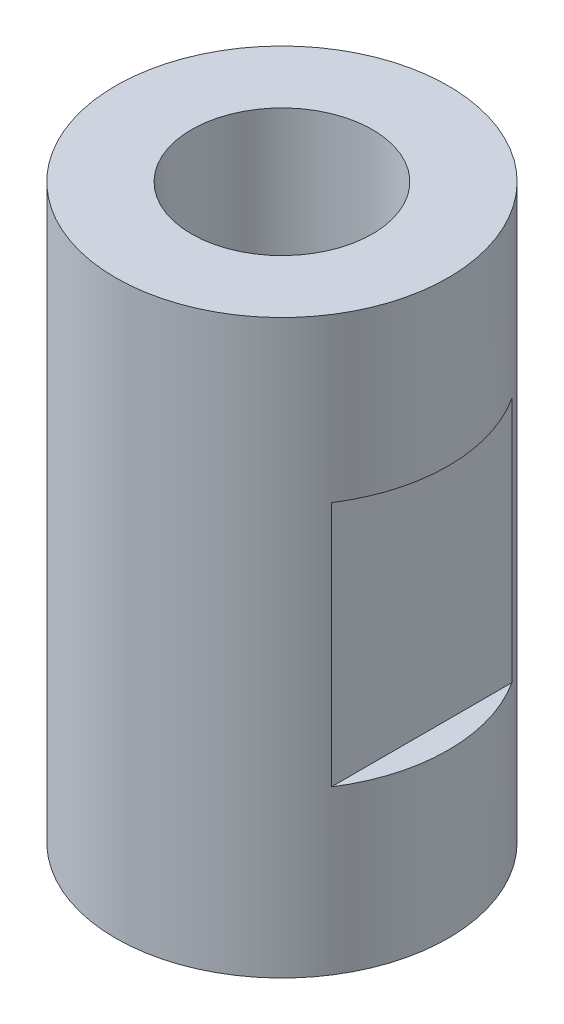
ISO-10303-21;
HEADER;
FILE_DESCRIPTION(('STEP AP214'),'2;1');
FILE_NAME('part.step','',(''),(''),'','','');
FILE_SCHEMA(('AUTOMOTIVE_DESIGN { 1 0 10303 214 1 1 1 1 }'));
ENDSEC;
DATA;
#1=APPLICATION_CONTEXT('core data for automotive mechanical design processes');
#2=APPLICATION_PROTOCOL_DEFINITION('international standard','automotive_design',2000,#1);
#3=PRODUCT_CONTEXT('',#1,'mechanical');
#4=PRODUCT('Part','Part','',(#3));
#5=PRODUCT_RELATED_PRODUCT_CATEGORY('part','',(#4));
#6=PRODUCT_DEFINITION_FORMATION('','',#4);
#7=PRODUCT_DEFINITION_CONTEXT('part definition',#1,'design');
#8=PRODUCT_DEFINITION('design','',#6,#7);
#9=PRODUCT_DEFINITION_SHAPE('','',#8);
#10=(LENGTH_UNIT() NAMED_UNIT(*) SI_UNIT(.MILLI.,.METRE.));
#11=(NAMED_UNIT(*) PLANE_ANGLE_UNIT() SI_UNIT($,.RADIAN.));
#12=(NAMED_UNIT(*) SI_UNIT($,.STERADIAN.) SOLID_ANGLE_UNIT());
#13=UNCERTAINTY_MEASURE_WITH_UNIT(LENGTH_MEASURE(1.E-05),#10,'distance_accuracy_value','');
#14=(GEOMETRIC_REPRESENTATION_CONTEXT(3) GLOBAL_UNCERTAINTY_ASSIGNED_CONTEXT((#13)) GLOBAL_UNIT_ASSIGNED_CONTEXT((#10,
#11,#12)) REPRESENTATION_CONTEXT('',''));
#15=CARTESIAN_POINT('',(0.,0.,0.));
#16=DIRECTION('',(0.,0.,1.));
#17=DIRECTION('',(1.,0.,0.));
#18=AXIS2_PLACEMENT_3D('',#15,#16,#17);
#19=CARTESIAN_POINT('',(0.,-21.844,0.));
#20=DIRECTION('',(0.,1.,0.));
#21=DIRECTION('',(0.,0.,1.));
#22=AXIS2_PLACEMENT_3D('',#19,#20,#21);
#23=CYLINDRICAL_SURFACE('',#22,6.35);
#24=CARTESIAN_POINT('',(0.,-6.223,0.));
#25=DIRECTION('',(0.,1.,0.));
#26=DIRECTION('',(0.,0.,1.));
#27=AXIS2_PLACEMENT_3D('',#24,#25,#26);
#28=CIRCLE('',#27,6.35);
#29=CARTESIAN_POINT('',(5.334,-6.223,-3.44542363142764));
#30=VERTEX_POINT('',#29);
#31=CARTESIAN_POINT('',(5.334,-6.223,3.44542363142764));
#32=VERTEX_POINT('',#31);
#33=EDGE_CURVE('E11',#30,#32,#28,.F.);
#34=ORIENTED_EDGE('',*,*,#33,.F.);
#35=DIRECTION('',(0.,1.,0.));
#36=VECTOR('',#35,1.);
#37=CARTESIAN_POINT('',(5.334,-21.844,-3.44542363142764));
#38=LINE('',#37,#36);
#39=CARTESIAN_POINT('',(5.334,-15.621,-3.44542363142764));
#40=VERTEX_POINT('',#39);
#41=EDGE_CURVE('E104',#40,#30,#38,.T.);
#42=ORIENTED_EDGE('',*,*,#41,.F.);
#43=CARTESIAN_POINT('',(0.,-15.621,0.));
#44=DIRECTION('',(0.,-1.,0.));
#45=DIRECTION('',(0.,0.,-1.));
#46=AXIS2_PLACEMENT_3D('',#43,#44,#45);
#47=CIRCLE('',#46,6.35);
#48=CARTESIAN_POINT('',(5.334,-15.621,3.44542363142764));
#49=VERTEX_POINT('',#48);
#50=EDGE_CURVE('E102',#49,#40,#47,.F.);
#51=ORIENTED_EDGE('',*,*,#50,.F.);
#52=DIRECTION('',(0.,1.,0.));
#53=VECTOR('',#52,1.);
#54=CARTESIAN_POINT('',(5.334,-21.844,3.44542363142764));
#55=LINE('',#54,#53);
#56=EDGE_CURVE('E48',#32,#49,#55,.F.);
#57=ORIENTED_EDGE('',*,*,#56,.F.);
#58=EDGE_LOOP('',(#34,#42,#51,#57));
#59=FACE_BOUND('',#58,.T.);
#60=CARTESIAN_POINT('',(0.,-6.223,0.));
#61=DIRECTION('',(0.,1.,0.));
#62=DIRECTION('',(0.,0.,1.));
#63=AXIS2_PLACEMENT_3D('',#60,#61,#62);
#64=CIRCLE('',#63,6.35);
#65=CARTESIAN_POINT('',(-5.334,-6.223,3.44542363142764));
#66=VERTEX_POINT('',#65);
#67=CARTESIAN_POINT('',(-5.334,-6.223,-3.44542363142764));
#68=VERTEX_POINT('',#67);
#69=EDGE_CURVE('E96',#66,#68,#64,.F.);
#70=ORIENTED_EDGE('',*,*,#69,.F.);
#71=DIRECTION('',(0.,1.,0.));
#72=VECTOR('',#71,1.);
#73=CARTESIAN_POINT('',(-5.334,-21.844,3.44542363142763));
#74=LINE('',#73,#72);
#75=CARTESIAN_POINT('',(-5.334,-15.621,3.44542363142763));
#76=VERTEX_POINT('',#75);
#77=EDGE_CURVE('E83',#76,#66,#74,.T.);
#78=ORIENTED_EDGE('',*,*,#77,.F.);
#79=CARTESIAN_POINT('',(0.,-15.621,0.));
#80=DIRECTION('',(0.,-1.,0.));
#81=DIRECTION('',(0.,0.,-1.));
#82=AXIS2_PLACEMENT_3D('',#79,#80,#81);
#83=CIRCLE('',#82,6.35);
#84=CARTESIAN_POINT('',(-5.334,-15.621,-3.44542363142763));
#85=VERTEX_POINT('',#84);
#86=EDGE_CURVE('E78',#85,#76,#83,.F.);
#87=ORIENTED_EDGE('',*,*,#86,.F.);
#88=DIRECTION('',(0.,1.,0.));
#89=VECTOR('',#88,1.);
#90=CARTESIAN_POINT('',(-5.334,-21.844,-3.44542363142763));
#91=LINE('',#90,#89);
#92=EDGE_CURVE('E90',#68,#85,#91,.F.);
#93=ORIENTED_EDGE('',*,*,#92,.F.);
#94=EDGE_LOOP('',(#70,#78,#87,#93));
#95=FACE_BOUND('',#94,.T.);
#96=CARTESIAN_POINT('',(0.,-21.844,0.));
#97=DIRECTION('',(0.,1.,0.));
#98=DIRECTION('',(0.,0.,1.));
#99=AXIS2_PLACEMENT_3D('',#96,#97,#98);
#100=CIRCLE('',#99,6.35);
#101=CARTESIAN_POINT('',(0.,-21.844,6.35));
#102=VERTEX_POINT('',#101);
#103=EDGE_CURVE('E84',#102,#102,#100,.T.);
#104=ORIENTED_EDGE('',*,*,#103,.T.);
#105=EDGE_LOOP('',(#104));
#106=FACE_BOUND('',#105,.T.);
#107=CARTESIAN_POINT('',(0.,0.,0.));
#108=DIRECTION('',(0.,1.,0.));
#109=DIRECTION('',(0.,0.,1.));
#110=AXIS2_PLACEMENT_3D('',#107,#108,#109);
#111=CIRCLE('',#110,6.35);
#112=CARTESIAN_POINT('',(0.,0.,6.35));
#113=VERTEX_POINT('',#112);
#114=EDGE_CURVE('E158',#113,#113,#111,.T.);
#115=ORIENTED_EDGE('',*,*,#114,.F.);
#116=EDGE_LOOP('',(#115));
#117=FACE_BOUND('',#116,.T.);
#118=ADVANCED_FACE('F40',(#59,#95,#106,#117),#23,.T.);
#119=CARTESIAN_POINT('',(0.,-21.844,0.));
#120=DIRECTION('',(0.,1.,0.));
#121=DIRECTION('',(0.,0.,1.));
#122=AXIS2_PLACEMENT_3D('',#119,#120,#121);
#123=PLANE('',#122);
#124=CARTESIAN_POINT('',(0.,-21.844,0.));
#125=DIRECTION('',(0.,1.,0.));
#126=DIRECTION('',(0.,0.,1.));
#127=AXIS2_PLACEMENT_3D('',#124,#125,#126);
#128=CIRCLE('',#127,2.1);
#129=CARTESIAN_POINT('',(0.,-21.844,2.1));
#130=VERTEX_POINT('',#129);
#131=EDGE_CURVE('E92',#130,#130,#128,.T.);
#132=ORIENTED_EDGE('',*,*,#131,.T.);
#133=EDGE_LOOP('',(#132));
#134=FACE_BOUND('',#133,.T.);
#135=ORIENTED_EDGE('',*,*,#103,.F.);
#136=EDGE_LOOP('',(#135));
#137=FACE_BOUND('',#136,.T.);
#138=ADVANCED_FACE('F131',(#134,#137),#123,.F.);
#139=CARTESIAN_POINT('',(0.,0.,0.));
#140=DIRECTION('',(0.,1.,0.));
#141=DIRECTION('',(0.,0.,1.));
#142=AXIS2_PLACEMENT_3D('',#139,#140,#141);
#143=PLANE('',#142);
#144=CARTESIAN_POINT('',(0.,0.,0.));
#145=DIRECTION('',(0.,1.,0.));
#146=DIRECTION('',(0.,0.,1.));
#147=AXIS2_PLACEMENT_3D('',#144,#145,#146);
#148=CIRCLE('',#147,3.4544);
#149=CARTESIAN_POINT('',(0.,0.,3.4544));
#150=VERTEX_POINT('',#149);
#151=EDGE_CURVE('E168',#150,#150,#148,.T.);
#152=ORIENTED_EDGE('',*,*,#151,.F.);
#153=EDGE_LOOP('',(#152));
#154=FACE_BOUND('',#153,.T.);
#155=ORIENTED_EDGE('',*,*,#114,.T.);
#156=EDGE_LOOP('',(#155));
#157=FACE_BOUND('',#156,.T.);
#158=ADVANCED_FACE('F135',(#154,#157),#143,.T.);
#159=CARTESIAN_POINT('',(-5.334,-6.223,6.35));
#160=DIRECTION('',(1.,0.,0.));
#161=DIRECTION('',(0.,1.,0.));
#162=AXIS2_PLACEMENT_3D('',#159,#160,#161);
#163=PLANE('',#162);
#164=ORIENTED_EDGE('',*,*,#92,.T.);
#165=DIRECTION('',(0.,0.,-1.));
#166=VECTOR('',#165,1.);
#167=CARTESIAN_POINT('',(-5.334,-15.621,6.35));
#168=LINE('',#167,#166);
#169=EDGE_CURVE('E61',#76,#85,#168,.T.);
#170=ORIENTED_EDGE('',*,*,#169,.F.);
#171=ORIENTED_EDGE('',*,*,#77,.T.);
#172=DIRECTION('',(0.,0.,-1.));
#173=VECTOR('',#172,1.);
#174=CARTESIAN_POINT('',(-5.334,-6.223,6.35));
#175=LINE('',#174,#173);
#176=EDGE_CURVE('E91',#66,#68,#175,.T.);
#177=ORIENTED_EDGE('',*,*,#176,.T.);
#178=EDGE_LOOP('',(#164,#170,#171,#177));
#179=FACE_BOUND('',#178,.T.);
#180=ADVANCED_FACE('F87',(#179),#163,.F.);
#181=CARTESIAN_POINT('',(-5.334,-6.223,6.35));
#182=DIRECTION('',(0.,1.,0.));
#183=DIRECTION('',(0.,0.,1.));
#184=AXIS2_PLACEMENT_3D('',#181,#182,#183);
#185=PLANE('',#184);
#186=ORIENTED_EDGE('',*,*,#69,.T.);
#187=ORIENTED_EDGE('',*,*,#176,.F.);
#188=EDGE_LOOP('',(#186,#187));
#189=FACE_BOUND('',#188,.T.);
#190=ADVANCED_FACE('F147',(#189),#185,.F.);
#191=CARTESIAN_POINT('',(-5.334,-15.621,6.35));
#192=DIRECTION('',(0.,-1.,0.));
#193=DIRECTION('',(0.,0.,-1.));
#194=AXIS2_PLACEMENT_3D('',#191,#192,#193);
#195=PLANE('',#194);
#196=ORIENTED_EDGE('',*,*,#86,.T.);
#197=ORIENTED_EDGE('',*,*,#169,.T.);
#198=EDGE_LOOP('',(#196,#197));
#199=FACE_BOUND('',#198,.T.);
#200=ADVANCED_FACE('F79',(#199),#195,.F.);
#201=CARTESIAN_POINT('',(9.96410279363959,-6.223,6.35));
#202=DIRECTION('',(0.,1.,0.));
#203=DIRECTION('',(0.,0.,1.));
#204=AXIS2_PLACEMENT_3D('',#201,#202,#203);
#205=PLANE('',#204);
#206=ORIENTED_EDGE('',*,*,#33,.T.);
#207=DIRECTION('',(0.,0.,-1.));
#208=VECTOR('',#207,1.);
#209=CARTESIAN_POINT('',(5.334,-6.223,6.35));
#210=LINE('',#209,#208);
#211=EDGE_CURVE('E113',#32,#30,#210,.T.);
#212=ORIENTED_EDGE('',*,*,#211,.T.);
#213=EDGE_LOOP('',(#206,#212));
#214=FACE_BOUND('',#213,.T.);
#215=ADVANCED_FACE('F127',(#214),#205,.F.);
#216=CARTESIAN_POINT('',(5.334,-15.621,6.35));
#217=DIRECTION('',(-1.,0.,0.));
#218=DIRECTION('',(0.,0.,1.));
#219=AXIS2_PLACEMENT_3D('',#216,#217,#218);
#220=PLANE('',#219);
#221=ORIENTED_EDGE('',*,*,#56,.T.);
#222=DIRECTION('',(0.,0.,-1.));
#223=VECTOR('',#222,1.);
#224=CARTESIAN_POINT('',(5.334,-15.621,6.35));
#225=LINE('',#224,#223);
#226=EDGE_CURVE('E54',#49,#40,#225,.T.);
#227=ORIENTED_EDGE('',*,*,#226,.T.);
#228=ORIENTED_EDGE('',*,*,#41,.T.);
#229=ORIENTED_EDGE('',*,*,#211,.F.);
#230=EDGE_LOOP('',(#221,#227,#228,#229));
#231=FACE_BOUND('',#230,.T.);
#232=ADVANCED_FACE('F110',(#231),#220,.F.);
#233=CARTESIAN_POINT('',(9.96410279363959,-15.621,6.35));
#234=DIRECTION('',(0.,-1.,0.));
#235=DIRECTION('',(0.,0.,-1.));
#236=AXIS2_PLACEMENT_3D('',#233,#234,#235);
#237=PLANE('',#236);
#238=ORIENTED_EDGE('',*,*,#50,.T.);
#239=ORIENTED_EDGE('',*,*,#226,.F.);
#240=EDGE_LOOP('',(#238,#239));
#241=FACE_BOUND('',#240,.T.);
#242=ADVANCED_FACE('F116',(#241),#237,.F.);
#243=CARTESIAN_POINT('',(0.,0.,0.));
#244=DIRECTION('',(0.,1.,0.));
#245=DIRECTION('',(0.,0.,1.));
#246=AXIS2_PLACEMENT_3D('',#243,#244,#245);
#247=CYLINDRICAL_SURFACE('',#246,2.1);
#248=CARTESIAN_POINT('',(0.,-7.16380562241093,0.));
#249=DIRECTION('',(0.,1.,0.));
#250=DIRECTION('',(0.,0.,1.));
#251=AXIS2_PLACEMENT_3D('',#248,#249,#250);
#252=CIRCLE('',#251,2.1);
#253=CARTESIAN_POINT('',(0.,-7.16380562241093,2.1));
#254=VERTEX_POINT('',#253);
#255=EDGE_CURVE('E43',#254,#254,#252,.T.);
#256=ORIENTED_EDGE('',*,*,#255,.T.);
#257=EDGE_LOOP('',(#256));
#258=FACE_BOUND('',#257,.T.);
#259=ORIENTED_EDGE('',*,*,#131,.F.);
#260=EDGE_LOOP('',(#259));
#261=FACE_BOUND('',#260,.T.);
#262=ADVANCED_FACE('F118',(#258,#261),#247,.F.);
#263=CARTESIAN_POINT('',(0.,-6.35,0.));
#264=DIRECTION('',(0.,1.,0.));
#265=DIRECTION('',(0.,0.,1.));
#266=AXIS2_PLACEMENT_3D('',#263,#264,#265);
#267=CONICAL_SURFACE('',#266,3.4544,1.02974425867665);
#268=CARTESIAN_POINT('',(0.,-6.35,0.));
#269=DIRECTION('',(0.,1.,0.));
#270=DIRECTION('',(0.,0.,1.));
#271=AXIS2_PLACEMENT_3D('',#268,#269,#270);
#272=CIRCLE('',#271,3.4544);
#273=CARTESIAN_POINT('',(0.,-6.35,3.4544));
#274=VERTEX_POINT('',#273);
#275=EDGE_CURVE('E165',#274,#274,#272,.T.);
#276=ORIENTED_EDGE('',*,*,#275,.T.);
#277=EDGE_LOOP('',(#276));
#278=FACE_BOUND('',#277,.T.);
#279=ORIENTED_EDGE('',*,*,#255,.F.);
#280=EDGE_LOOP('',(#279));
#281=FACE_BOUND('',#280,.T.);
#282=ADVANCED_FACE('F124',(#278,#281),#267,.F.);
#283=CARTESIAN_POINT('',(0.,0.,0.));
#284=DIRECTION('',(0.,1.,0.));
#285=DIRECTION('',(0.,0.,1.));
#286=AXIS2_PLACEMENT_3D('',#283,#284,#285);
#287=CYLINDRICAL_SURFACE('',#286,3.4544);
#288=ORIENTED_EDGE('',*,*,#275,.F.);
#289=EDGE_LOOP('',(#288));
#290=FACE_BOUND('',#289,.T.);
#291=ORIENTED_EDGE('',*,*,#151,.T.);
#292=EDGE_LOOP('',(#291));
#293=FACE_BOUND('',#292,.T.);
#294=ADVANCED_FACE('F172',(#290,#293),#287,.F.);
#295=CLOSED_SHELL('',(#118,#138,#158,#180,#190,#200,#215,#232,#242,#262,#282,#294));
#296=MANIFOLD_SOLID_BREP('B2',#295);
#297=ADVANCED_BREP_SHAPE_REPRESENTATION('',(#18,#296),#14);
#298=SHAPE_DEFINITION_REPRESENTATION(#9,#297);
ENDSEC;
END-ISO-10303-21;
